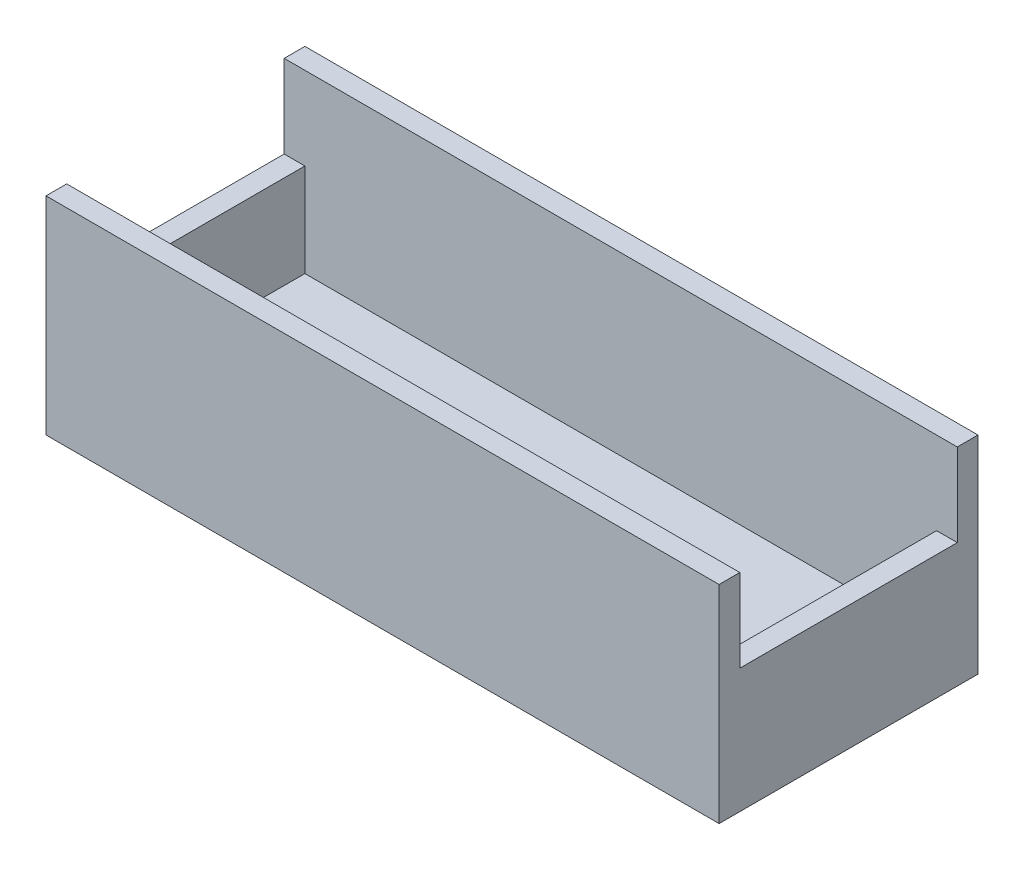
ISO-10303-21;
HEADER;
FILE_DESCRIPTION(('STEP AP214'),'2;1');
FILE_NAME('part.step','',(''),(''),'','','');
FILE_SCHEMA(('AUTOMOTIVE_DESIGN { 1 0 10303 214 1 1 1 1 }'));
ENDSEC;
DATA;
#1=APPLICATION_CONTEXT('core data for automotive mechanical design processes');
#2=APPLICATION_PROTOCOL_DEFINITION('international standard','automotive_design',2000,#1);
#3=PRODUCT_CONTEXT('',#1,'mechanical');
#4=PRODUCT('Part','Part','',(#3));
#5=PRODUCT_RELATED_PRODUCT_CATEGORY('part','',(#4));
#6=PRODUCT_DEFINITION_FORMATION('','',#4);
#7=PRODUCT_DEFINITION_CONTEXT('part definition',#1,'design');
#8=PRODUCT_DEFINITION('design','',#6,#7);
#9=PRODUCT_DEFINITION_SHAPE('','',#8);
#10=(LENGTH_UNIT() NAMED_UNIT(*) SI_UNIT(.MILLI.,.METRE.));
#11=(NAMED_UNIT(*) PLANE_ANGLE_UNIT() SI_UNIT($,.RADIAN.));
#12=(NAMED_UNIT(*) SI_UNIT($,.STERADIAN.) SOLID_ANGLE_UNIT());
#13=UNCERTAINTY_MEASURE_WITH_UNIT(LENGTH_MEASURE(1.E-05),#10,'distance_accuracy_value','');
#14=(GEOMETRIC_REPRESENTATION_CONTEXT(3) GLOBAL_UNCERTAINTY_ASSIGNED_CONTEXT((#13)) GLOBAL_UNIT_ASSIGNED_CONTEXT((#10,
#11,#12)) REPRESENTATION_CONTEXT('',''));
#15=CARTESIAN_POINT('',(0.,0.,0.));
#16=DIRECTION('',(0.,0.,1.));
#17=DIRECTION('',(1.,0.,0.));
#18=AXIS2_PLACEMENT_3D('',#15,#16,#17);
#19=CARTESIAN_POINT('',(0.,3.,0.));
#20=DIRECTION('',(0.,1.,0.));
#21=DIRECTION('',(0.,0.,1.));
#22=AXIS2_PLACEMENT_3D('',#19,#20,#21);
#23=PLANE('',#22);
#24=DIRECTION('',(1.,0.,0.));
#25=VECTOR('',#24,1.);
#26=CARTESIAN_POINT('',(0.,3.,23.));
#27=LINE('',#26,#25);
#28=CARTESIAN_POINT('',(2.,3.,23.));
#29=VERTEX_POINT('',#28);
#30=CARTESIAN_POINT('',(63.,3.,23.));
#31=VERTEX_POINT('',#30);
#32=EDGE_CURVE('E186',#29,#31,#27,.T.);
#33=ORIENTED_EDGE('',*,*,#32,.T.);
#34=DIRECTION('',(0.,0.,1.));
#35=VECTOR('',#34,1.);
#36=CARTESIAN_POINT('',(63.,3.,0.));
#37=LINE('',#36,#35);
#38=CARTESIAN_POINT('',(63.,3.,2.));
#39=VERTEX_POINT('',#38);
#40=EDGE_CURVE('E143',#39,#31,#37,.T.);
#41=ORIENTED_EDGE('',*,*,#40,.F.);
#42=DIRECTION('',(1.,0.,0.));
#43=VECTOR('',#42,1.);
#44=CARTESIAN_POINT('',(0.,3.,2.));
#45=LINE('',#44,#43);
#46=CARTESIAN_POINT('',(2.,3.,2.));
#47=VERTEX_POINT('',#46);
#48=EDGE_CURVE('E149',#47,#39,#45,.T.);
#49=ORIENTED_EDGE('',*,*,#48,.F.);
#50=DIRECTION('',(0.,0.,1.));
#51=VECTOR('',#50,1.);
#52=CARTESIAN_POINT('',(2.,3.,0.));
#53=LINE('',#52,#51);
#54=EDGE_CURVE('E150',#47,#29,#53,.T.);
#55=ORIENTED_EDGE('',*,*,#54,.T.);
#56=EDGE_LOOP('',(#33,#41,#49,#55));
#57=FACE_BOUND('',#56,.T.);
#58=ADVANCED_FACE('F39',(#57),#23,.T.);
#59=CARTESIAN_POINT('',(0.,20.,23.));
#60=DIRECTION('',(0.,0.,-1.));
#61=DIRECTION('',(-1.,0.,0.));
#62=AXIS2_PLACEMENT_3D('',#59,#60,#61);
#63=PLANE('',#62);
#64=DIRECTION('',(1.,0.,0.));
#65=VECTOR('',#64,1.);
#66=CARTESIAN_POINT('',(0.,12.,23.));
#67=LINE('',#66,#65);
#68=CARTESIAN_POINT('',(63.,12.,23.));
#69=VERTEX_POINT('',#68);
#70=CARTESIAN_POINT('',(65.,12.,23.));
#71=VERTEX_POINT('',#70);
#72=EDGE_CURVE('E136',#69,#71,#67,.T.);
#73=ORIENTED_EDGE('',*,*,#72,.F.);
#74=DIRECTION('',(0.,-1.,0.));
#75=VECTOR('',#74,1.);
#76=CARTESIAN_POINT('',(63.,12.,23.));
#77=LINE('',#76,#75);
#78=EDGE_CURVE('E134',#69,#31,#77,.T.);
#79=ORIENTED_EDGE('',*,*,#78,.T.);
#80=ORIENTED_EDGE('',*,*,#32,.F.);
#81=DIRECTION('',(0.,-1.,0.));
#82=VECTOR('',#81,1.);
#83=CARTESIAN_POINT('',(2.,12.,23.));
#84=LINE('',#83,#82);
#85=CARTESIAN_POINT('',(2.,12.,23.));
#86=VERTEX_POINT('',#85);
#87=EDGE_CURVE('E167',#86,#29,#84,.T.);
#88=ORIENTED_EDGE('',*,*,#87,.F.);
#89=DIRECTION('',(-1.,0.,0.));
#90=VECTOR('',#89,1.);
#91=CARTESIAN_POINT('',(0.,12.,23.));
#92=LINE('',#91,#90);
#93=CARTESIAN_POINT('',(0.,12.,23.));
#94=VERTEX_POINT('',#93);
#95=EDGE_CURVE('E153',#86,#94,#92,.T.);
#96=ORIENTED_EDGE('',*,*,#95,.T.);
#97=DIRECTION('',(0.,-1.,0.));
#98=VECTOR('',#97,1.);
#99=CARTESIAN_POINT('',(0.,20.,23.));
#100=LINE('',#99,#98);
#101=CARTESIAN_POINT('',(0.,20.,23.));
#102=VERTEX_POINT('',#101);
#103=EDGE_CURVE('E203',#102,#94,#100,.T.);
#104=ORIENTED_EDGE('',*,*,#103,.F.);
#105=DIRECTION('',(1.,0.,0.));
#106=VECTOR('',#105,1.);
#107=CARTESIAN_POINT('',(0.,20.,23.));
#108=LINE('',#107,#106);
#109=CARTESIAN_POINT('',(65.,20.,23.));
#110=VERTEX_POINT('',#109);
#111=EDGE_CURVE('E187',#102,#110,#108,.T.);
#112=ORIENTED_EDGE('',*,*,#111,.T.);
#113=DIRECTION('',(0.,-1.,0.));
#114=VECTOR('',#113,1.);
#115=CARTESIAN_POINT('',(65.,20.,23.));
#116=LINE('',#115,#114);
#117=EDGE_CURVE('E198',#110,#71,#116,.T.);
#118=ORIENTED_EDGE('',*,*,#117,.T.);
#119=EDGE_LOOP('',(#73,#79,#80,#88,#96,#104,#112,#118));
#120=FACE_BOUND('',#119,.T.);
#121=ADVANCED_FACE('F247',(#120),#63,.T.);
#122=CARTESIAN_POINT('',(0.,20.,2.));
#123=DIRECTION('',(0.,0.,-1.));
#124=DIRECTION('',(-1.,0.,0.));
#125=AXIS2_PLACEMENT_3D('',#122,#123,#124);
#126=PLANE('',#125);
#127=DIRECTION('',(0.,-1.,0.));
#128=VECTOR('',#127,1.);
#129=CARTESIAN_POINT('',(63.,12.,2.));
#130=LINE('',#129,#128);
#131=CARTESIAN_POINT('',(63.,12.,2.));
#132=VERTEX_POINT('',#131);
#133=EDGE_CURVE('E131',#132,#39,#130,.T.);
#134=ORIENTED_EDGE('',*,*,#133,.F.);
#135=DIRECTION('',(1.,0.,0.));
#136=VECTOR('',#135,1.);
#137=CARTESIAN_POINT('',(0.,12.,1.99999999999995));
#138=LINE('',#137,#136);
#139=CARTESIAN_POINT('',(65.,12.,2.));
#140=VERTEX_POINT('',#139);
#141=EDGE_CURVE('E137',#132,#140,#138,.T.);
#142=ORIENTED_EDGE('',*,*,#141,.T.);
#143=DIRECTION('',(0.,-1.,0.));
#144=VECTOR('',#143,1.);
#145=CARTESIAN_POINT('',(65.,20.,2.));
#146=LINE('',#145,#144);
#147=CARTESIAN_POINT('',(65.,20.,2.));
#148=VERTEX_POINT('',#147);
#149=EDGE_CURVE('E184',#148,#140,#146,.T.);
#150=ORIENTED_EDGE('',*,*,#149,.F.);
#151=DIRECTION('',(1.,0.,0.));
#152=VECTOR('',#151,1.);
#153=CARTESIAN_POINT('',(0.,20.,2.));
#154=LINE('',#153,#152);
#155=CARTESIAN_POINT('',(0.,20.,2.));
#156=VERTEX_POINT('',#155);
#157=EDGE_CURVE('E169',#156,#148,#154,.T.);
#158=ORIENTED_EDGE('',*,*,#157,.F.);
#159=DIRECTION('',(0.,-1.,0.));
#160=VECTOR('',#159,1.);
#161=CARTESIAN_POINT('',(0.,20.,2.));
#162=LINE('',#161,#160);
#163=CARTESIAN_POINT('',(0.,12.,2.));
#164=VERTEX_POINT('',#163);
#165=EDGE_CURVE('E180',#156,#164,#162,.T.);
#166=ORIENTED_EDGE('',*,*,#165,.T.);
#167=DIRECTION('',(-1.,0.,0.));
#168=VECTOR('',#167,1.);
#169=CARTESIAN_POINT('',(0.,12.,2.));
#170=LINE('',#169,#168);
#171=CARTESIAN_POINT('',(2.,12.,2.));
#172=VERTEX_POINT('',#171);
#173=EDGE_CURVE('E161',#172,#164,#170,.T.);
#174=ORIENTED_EDGE('',*,*,#173,.F.);
#175=DIRECTION('',(0.,-1.,0.));
#176=VECTOR('',#175,1.);
#177=CARTESIAN_POINT('',(2.,12.,2.));
#178=LINE('',#177,#176);
#179=EDGE_CURVE('E164',#172,#47,#178,.T.);
#180=ORIENTED_EDGE('',*,*,#179,.T.);
#181=ORIENTED_EDGE('',*,*,#48,.T.);
#182=EDGE_LOOP('',(#134,#142,#150,#158,#166,#174,#180,#181));
#183=FACE_BOUND('',#182,.T.);
#184=ADVANCED_FACE('F146',(#183),#126,.F.);
#185=CARTESIAN_POINT('',(0.,3.,0.));
#186=DIRECTION('',(1.,0.,0.));
#187=DIRECTION('',(0.,0.,-1.));
#188=AXIS2_PLACEMENT_3D('',#185,#186,#187);
#189=PLANE('',#188);
#190=DIRECTION('',(0.,0.,1.));
#191=VECTOR('',#190,1.);
#192=CARTESIAN_POINT('',(0.,0.,0.));
#193=LINE('',#192,#191);
#194=CARTESIAN_POINT('',(0.,0.,0.));
#195=VERTEX_POINT('',#194);
#196=CARTESIAN_POINT('',(0.,0.,25.));
#197=VERTEX_POINT('',#196);
#198=EDGE_CURVE('E206',#195,#197,#193,.T.);
#199=ORIENTED_EDGE('',*,*,#198,.T.);
#200=DIRECTION('',(0.,-1.,0.));
#201=VECTOR('',#200,1.);
#202=CARTESIAN_POINT('',(0.,3.,25.));
#203=LINE('',#202,#201);
#204=CARTESIAN_POINT('',(0.,20.,25.));
#205=VERTEX_POINT('',#204);
#206=EDGE_CURVE('E11',#205,#197,#203,.T.);
#207=ORIENTED_EDGE('',*,*,#206,.F.);
#208=DIRECTION('',(0.,0.,1.));
#209=VECTOR('',#208,1.);
#210=CARTESIAN_POINT('',(0.,20.,0.));
#211=LINE('',#210,#209);
#212=EDGE_CURVE('E190',#102,#205,#211,.T.);
#213=ORIENTED_EDGE('',*,*,#212,.F.);
#214=ORIENTED_EDGE('',*,*,#103,.T.);
#215=DIRECTION('',(0.,0.,1.));
#216=VECTOR('',#215,1.);
#217=CARTESIAN_POINT('',(0.,12.,0.));
#218=LINE('',#217,#216);
#219=EDGE_CURVE('E163',#164,#94,#218,.T.);
#220=ORIENTED_EDGE('',*,*,#219,.F.);
#221=ORIENTED_EDGE('',*,*,#165,.F.);
#222=DIRECTION('',(0.,0.,1.));
#223=VECTOR('',#222,1.);
#224=CARTESIAN_POINT('',(0.,20.,0.));
#225=LINE('',#224,#223);
#226=CARTESIAN_POINT('',(0.,20.,0.));
#227=VERTEX_POINT('',#226);
#228=EDGE_CURVE('E178',#227,#156,#225,.T.);
#229=ORIENTED_EDGE('',*,*,#228,.F.);
#230=DIRECTION('',(0.,-1.,0.));
#231=VECTOR('',#230,1.);
#232=CARTESIAN_POINT('',(0.,3.,0.));
#233=LINE('',#232,#231);
#234=EDGE_CURVE('E215',#227,#195,#233,.T.);
#235=ORIENTED_EDGE('',*,*,#234,.T.);
#236=EDGE_LOOP('',(#199,#207,#213,#214,#220,#221,#229,#235));
#237=FACE_BOUND('',#236,.T.);
#238=ADVANCED_FACE('F41',(#237),#189,.F.);
#239=CARTESIAN_POINT('',(0.,3.,25.));
#240=DIRECTION('',(0.,0.,-1.));
#241=DIRECTION('',(-1.,0.,0.));
#242=AXIS2_PLACEMENT_3D('',#239,#240,#241);
#243=PLANE('',#242);
#244=DIRECTION('',(1.,0.,0.));
#245=VECTOR('',#244,1.);
#246=CARTESIAN_POINT('',(0.,0.,25.));
#247=LINE('',#246,#245);
#248=CARTESIAN_POINT('',(65.,0.,25.));
#249=VERTEX_POINT('',#248);
#250=EDGE_CURVE('E209',#197,#249,#247,.T.);
#251=ORIENTED_EDGE('',*,*,#250,.T.);
#252=DIRECTION('',(0.,-1.,0.));
#253=VECTOR('',#252,1.);
#254=CARTESIAN_POINT('',(65.,3.,25.));
#255=LINE('',#254,#253);
#256=CARTESIAN_POINT('',(65.,20.,25.));
#257=VERTEX_POINT('',#256);
#258=EDGE_CURVE('E47',#257,#249,#255,.T.);
#259=ORIENTED_EDGE('',*,*,#258,.F.);
#260=DIRECTION('',(1.,0.,0.));
#261=VECTOR('',#260,1.);
#262=CARTESIAN_POINT('',(0.,20.,25.));
#263=LINE('',#262,#261);
#264=EDGE_CURVE('E193',#205,#257,#263,.T.);
#265=ORIENTED_EDGE('',*,*,#264,.F.);
#266=ORIENTED_EDGE('',*,*,#206,.T.);
#267=EDGE_LOOP('',(#251,#259,#265,#266));
#268=FACE_BOUND('',#267,.T.);
#269=ADVANCED_FACE('F269',(#268),#243,.F.);
#270=CARTESIAN_POINT('',(65.,3.,0.));
#271=DIRECTION('',(-1.,0.,0.));
#272=DIRECTION('',(0.,0.,1.));
#273=AXIS2_PLACEMENT_3D('',#270,#271,#272);
#274=PLANE('',#273);
#275=DIRECTION('',(0.,0.,-1.));
#276=VECTOR('',#275,1.);
#277=CARTESIAN_POINT('',(65.,0.,0.));
#278=LINE('',#277,#276);
#279=CARTESIAN_POINT('',(65.,0.,0.));
#280=VERTEX_POINT('',#279);
#281=EDGE_CURVE('E211',#249,#280,#278,.T.);
#282=ORIENTED_EDGE('',*,*,#281,.T.);
#283=DIRECTION('',(0.,-1.,0.));
#284=VECTOR('',#283,1.);
#285=CARTESIAN_POINT('',(65.,3.,0.));
#286=LINE('',#285,#284);
#287=CARTESIAN_POINT('',(65.,20.,0.));
#288=VERTEX_POINT('',#287);
#289=EDGE_CURVE('E218',#288,#280,#286,.T.);
#290=ORIENTED_EDGE('',*,*,#289,.F.);
#291=DIRECTION('',(0.,0.,-1.));
#292=VECTOR('',#291,1.);
#293=CARTESIAN_POINT('',(65.,20.,0.));
#294=LINE('',#293,#292);
#295=EDGE_CURVE('E172',#148,#288,#294,.T.);
#296=ORIENTED_EDGE('',*,*,#295,.F.);
#297=ORIENTED_EDGE('',*,*,#149,.T.);
#298=DIRECTION('',(0.,0.,-1.));
#299=VECTOR('',#298,1.);
#300=CARTESIAN_POINT('',(65.,12.,0.));
#301=LINE('',#300,#299);
#302=EDGE_CURVE('E54',#71,#140,#301,.T.);
#303=ORIENTED_EDGE('',*,*,#302,.F.);
#304=ORIENTED_EDGE('',*,*,#117,.F.);
#305=DIRECTION('',(0.,0.,-1.));
#306=VECTOR('',#305,1.);
#307=CARTESIAN_POINT('',(65.,20.,0.));
#308=LINE('',#307,#306);
#309=EDGE_CURVE('E196',#257,#110,#308,.T.);
#310=ORIENTED_EDGE('',*,*,#309,.F.);
#311=ORIENTED_EDGE('',*,*,#258,.T.);
#312=EDGE_LOOP('',(#282,#290,#296,#297,#303,#304,#310,#311));
#313=FACE_BOUND('',#312,.T.);
#314=ADVANCED_FACE('F224',(#313),#274,.F.);
#315=CARTESIAN_POINT('',(0.,3.,0.));
#316=DIRECTION('',(0.,0.,1.));
#317=DIRECTION('',(1.,0.,0.));
#318=AXIS2_PLACEMENT_3D('',#315,#316,#317);
#319=PLANE('',#318);
#320=DIRECTION('',(-1.,0.,0.));
#321=VECTOR('',#320,1.);
#322=CARTESIAN_POINT('',(0.,0.,0.));
#323=LINE('',#322,#321);
#324=EDGE_CURVE('E213',#280,#195,#323,.T.);
#325=ORIENTED_EDGE('',*,*,#324,.T.);
#326=ORIENTED_EDGE('',*,*,#234,.F.);
#327=DIRECTION('',(-1.,0.,0.));
#328=VECTOR('',#327,1.);
#329=CARTESIAN_POINT('',(0.,20.,0.));
#330=LINE('',#329,#328);
#331=EDGE_CURVE('E175',#288,#227,#330,.T.);
#332=ORIENTED_EDGE('',*,*,#331,.F.);
#333=ORIENTED_EDGE('',*,*,#289,.T.);
#334=EDGE_LOOP('',(#325,#326,#332,#333));
#335=FACE_BOUND('',#334,.T.);
#336=ADVANCED_FACE('F233',(#335),#319,.F.);
#337=CARTESIAN_POINT('',(0.,0.,0.));
#338=DIRECTION('',(0.,1.,0.));
#339=DIRECTION('',(0.,0.,1.));
#340=AXIS2_PLACEMENT_3D('',#337,#338,#339);
#341=PLANE('',#340);
#342=ORIENTED_EDGE('',*,*,#198,.F.);
#343=ORIENTED_EDGE('',*,*,#324,.F.);
#344=ORIENTED_EDGE('',*,*,#281,.F.);
#345=ORIENTED_EDGE('',*,*,#250,.F.);
#346=EDGE_LOOP('',(#342,#343,#344,#345));
#347=FACE_BOUND('',#346,.T.);
#348=ADVANCED_FACE('F231',(#347),#341,.F.);
#349=CARTESIAN_POINT('',(0.,20.,0.));
#350=DIRECTION('',(0.,1.,0.));
#351=DIRECTION('',(0.,0.,1.));
#352=AXIS2_PLACEMENT_3D('',#349,#350,#351);
#353=PLANE('',#352);
#354=ORIENTED_EDGE('',*,*,#111,.F.);
#355=ORIENTED_EDGE('',*,*,#212,.T.);
#356=ORIENTED_EDGE('',*,*,#264,.T.);
#357=ORIENTED_EDGE('',*,*,#309,.T.);
#358=EDGE_LOOP('',(#354,#355,#356,#357));
#359=FACE_BOUND('',#358,.T.);
#360=ADVANCED_FACE('F265',(#359),#353,.T.);
#361=CARTESIAN_POINT('',(0.,20.,0.));
#362=DIRECTION('',(0.,1.,0.));
#363=DIRECTION('',(0.,0.,1.));
#364=AXIS2_PLACEMENT_3D('',#361,#362,#363);
#365=PLANE('',#364);
#366=ORIENTED_EDGE('',*,*,#157,.T.);
#367=ORIENTED_EDGE('',*,*,#295,.T.);
#368=ORIENTED_EDGE('',*,*,#331,.T.);
#369=ORIENTED_EDGE('',*,*,#228,.T.);
#370=EDGE_LOOP('',(#366,#367,#368,#369));
#371=FACE_BOUND('',#370,.T.);
#372=ADVANCED_FACE('F241',(#371),#365,.T.);
#373=CARTESIAN_POINT('',(2.,12.,0.));
#374=DIRECTION('',(1.,0.,0.));
#375=DIRECTION('',(0.,0.,-1.));
#376=AXIS2_PLACEMENT_3D('',#373,#374,#375);
#377=PLANE('',#376);
#378=ORIENTED_EDGE('',*,*,#54,.F.);
#379=ORIENTED_EDGE('',*,*,#179,.F.);
#380=DIRECTION('',(0.,0.,1.));
#381=VECTOR('',#380,1.);
#382=CARTESIAN_POINT('',(2.,12.,0.));
#383=LINE('',#382,#381);
#384=EDGE_CURVE('E62',#172,#86,#383,.T.);
#385=ORIENTED_EDGE('',*,*,#384,.T.);
#386=ORIENTED_EDGE('',*,*,#87,.T.);
#387=EDGE_LOOP('',(#378,#379,#385,#386));
#388=FACE_BOUND('',#387,.T.);
#389=ADVANCED_FACE('F251',(#388),#377,.T.);
#390=CARTESIAN_POINT('',(0.,12.,0.));
#391=DIRECTION('',(0.,1.,0.));
#392=DIRECTION('',(0.,0.,1.));
#393=AXIS2_PLACEMENT_3D('',#390,#391,#392);
#394=PLANE('',#393);
#395=ORIENTED_EDGE('',*,*,#95,.F.);
#396=ORIENTED_EDGE('',*,*,#384,.F.);
#397=ORIENTED_EDGE('',*,*,#173,.T.);
#398=ORIENTED_EDGE('',*,*,#219,.T.);
#399=EDGE_LOOP('',(#395,#396,#397,#398));
#400=FACE_BOUND('',#399,.T.);
#401=ADVANCED_FACE('F243',(#400),#394,.T.);
#402=CARTESIAN_POINT('',(63.,12.,0.));
#403=DIRECTION('',(1.,0.,0.));
#404=DIRECTION('',(0.,0.,-1.));
#405=AXIS2_PLACEMENT_3D('',#402,#403,#404);
#406=PLANE('',#405);
#407=ORIENTED_EDGE('',*,*,#40,.T.);
#408=ORIENTED_EDGE('',*,*,#78,.F.);
#409=DIRECTION('',(0.,0.,1.));
#410=VECTOR('',#409,1.);
#411=CARTESIAN_POINT('',(63.,12.,0.));
#412=LINE('',#411,#410);
#413=EDGE_CURVE('E128',#132,#69,#412,.T.);
#414=ORIENTED_EDGE('',*,*,#413,.F.);
#415=ORIENTED_EDGE('',*,*,#133,.T.);
#416=EDGE_LOOP('',(#407,#408,#414,#415));
#417=FACE_BOUND('',#416,.T.);
#418=ADVANCED_FACE('F129',(#417),#406,.F.);
#419=CARTESIAN_POINT('',(0.,12.,0.));
#420=DIRECTION('',(0.,1.,0.));
#421=DIRECTION('',(0.,0.,1.));
#422=AXIS2_PLACEMENT_3D('',#419,#420,#421);
#423=PLANE('',#422);
#424=ORIENTED_EDGE('',*,*,#141,.F.);
#425=ORIENTED_EDGE('',*,*,#413,.T.);
#426=ORIENTED_EDGE('',*,*,#72,.T.);
#427=ORIENTED_EDGE('',*,*,#302,.T.);
#428=EDGE_LOOP('',(#424,#425,#426,#427));
#429=FACE_BOUND('',#428,.T.);
#430=ADVANCED_FACE('F139',(#429),#423,.T.);
#431=CLOSED_SHELL('',(#58,#121,#184,#238,#269,#314,#336,#348,#360,#372,#389,#401,#418,#430));
#432=MANIFOLD_SOLID_BREP('B2',#431);
#433=ADVANCED_BREP_SHAPE_REPRESENTATION('',(#18,#432),#14);
#434=SHAPE_DEFINITION_REPRESENTATION(#9,#433);
ENDSEC;
END-ISO-10303-21;
